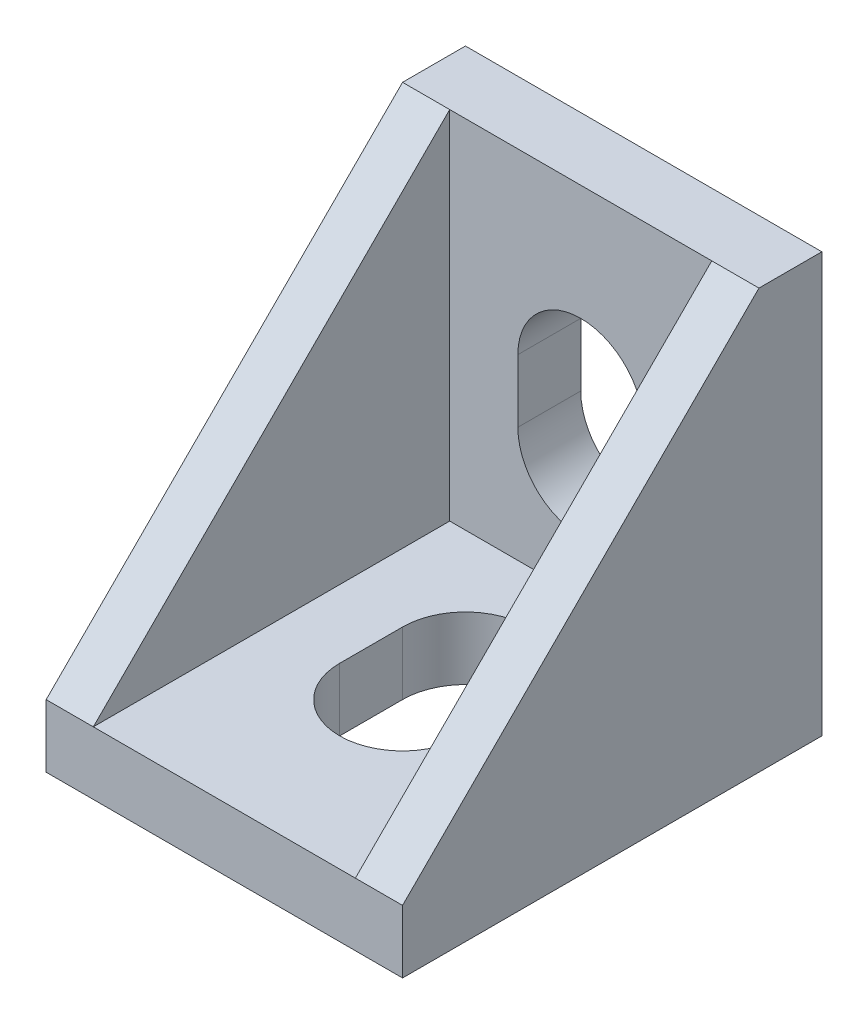
ISO-10303-21;
HEADER;
FILE_DESCRIPTION(('STEP AP214'),'2;1');
FILE_NAME('part.step','',(''),(''),'','','');
FILE_SCHEMA(('AUTOMOTIVE_DESIGN { 1 0 10303 214 1 1 1 1 }'));
ENDSEC;
DATA;
#1=APPLICATION_CONTEXT('core data for automotive mechanical design processes');
#2=APPLICATION_PROTOCOL_DEFINITION('international standard','automotive_design',2000,#1);
#3=PRODUCT_CONTEXT('',#1,'mechanical');
#4=PRODUCT('Part','Part','',(#3));
#5=PRODUCT_RELATED_PRODUCT_CATEGORY('part','',(#4));
#6=PRODUCT_DEFINITION_FORMATION('','',#4);
#7=PRODUCT_DEFINITION_CONTEXT('part definition',#1,'design');
#8=PRODUCT_DEFINITION('design','',#6,#7);
#9=PRODUCT_DEFINITION_SHAPE('','',#8);
#10=(LENGTH_UNIT() NAMED_UNIT(*) SI_UNIT(.MILLI.,.METRE.));
#11=(NAMED_UNIT(*) PLANE_ANGLE_UNIT() SI_UNIT($,.RADIAN.));
#12=(NAMED_UNIT(*) SI_UNIT($,.STERADIAN.) SOLID_ANGLE_UNIT());
#13=UNCERTAINTY_MEASURE_WITH_UNIT(LENGTH_MEASURE(1.E-05),#10,'distance_accuracy_value','');
#14=(GEOMETRIC_REPRESENTATION_CONTEXT(3) GLOBAL_UNCERTAINTY_ASSIGNED_CONTEXT((#13)) GLOBAL_UNIT_ASSIGNED_CONTEXT((#10,
#11,#12)) REPRESENTATION_CONTEXT('',''));
#15=CARTESIAN_POINT('',(0.,0.,0.));
#16=DIRECTION('',(0.,0.,1.));
#17=DIRECTION('',(1.,0.,0.));
#18=AXIS2_PLACEMENT_3D('',#15,#16,#17);
#19=CARTESIAN_POINT('',(17.,-10.,10.));
#20=DIRECTION('',(0.,1.,0.));
#21=DIRECTION('',(0.,0.,1.));
#22=AXIS2_PLACEMENT_3D('',#19,#20,#21);
#23=PLANE('',#22);
#24=CARTESIAN_POINT('',(9.525,-10.,-7.25));
#25=DIRECTION('',(0.,-1.,0.));
#26=DIRECTION('',(0.,0.,-1.));
#27=AXIS2_PLACEMENT_3D('',#24,#25,#26);
#28=CIRCLE('',#27,0.875);
#29=CARTESIAN_POINT('',(9.525,-10.,-8.125));
#30=VERTEX_POINT('',#29);
#31=CARTESIAN_POINT('',(9.525,-10.,-6.375));
#32=VERTEX_POINT('',#31);
#33=EDGE_CURVE('E263',#30,#32,#28,.T.);
#34=ORIENTED_EDGE('',*,*,#33,.F.);
#35=DIRECTION('',(1.,0.,0.));
#36=VECTOR('',#35,1.);
#37=CARTESIAN_POINT('',(9.525,-10.,-8.125));
#38=LINE('',#37,#36);
#39=CARTESIAN_POINT('',(7.475,-10.,-8.125));
#40=VERTEX_POINT('',#39);
#41=EDGE_CURVE('E276',#40,#30,#38,.T.);
#42=ORIENTED_EDGE('',*,*,#41,.F.);
#43=CARTESIAN_POINT('',(7.475,-10.,-7.25));
#44=DIRECTION('',(0.,-1.,0.));
#45=DIRECTION('',(0.,0.,-1.));
#46=AXIS2_PLACEMENT_3D('',#43,#44,#45);
#47=CIRCLE('',#46,0.875);
#48=CARTESIAN_POINT('',(7.475,-10.,-6.375));
#49=VERTEX_POINT('',#48);
#50=EDGE_CURVE('E285',#49,#40,#47,.T.);
#51=ORIENTED_EDGE('',*,*,#50,.F.);
#52=DIRECTION('',(-1.,0.,0.));
#53=VECTOR('',#52,1.);
#54=CARTESIAN_POINT('',(9.525,-10.,-6.375));
#55=LINE('',#54,#53);
#56=EDGE_CURVE('E266',#32,#49,#55,.T.);
#57=ORIENTED_EDGE('',*,*,#56,.F.);
#58=EDGE_LOOP('',(#34,#42,#51,#57));
#59=FACE_BOUND('',#58,.T.);
#60=DIRECTION('',(0.,0.,1.));
#61=VECTOR('',#60,1.);
#62=CARTESIAN_POINT('',(11.5,-10.,-1.5));
#63=LINE('',#62,#61);
#64=CARTESIAN_POINT('',(11.5,-10.,-1.5));
#65=VERTEX_POINT('',#64);
#66=CARTESIAN_POINT('',(11.5,-10.,1.5));
#67=VERTEX_POINT('',#66);
#68=EDGE_CURVE('E369',#65,#67,#63,.T.);
#69=ORIENTED_EDGE('',*,*,#68,.F.);
#70=CARTESIAN_POINT('',(8.5,-10.,-1.5));
#71=DIRECTION('',(0.,-1.,0.));
#72=DIRECTION('',(0.,0.,-1.));
#73=AXIS2_PLACEMENT_3D('',#70,#71,#72);
#74=CIRCLE('',#73,3.);
#75=CARTESIAN_POINT('',(5.5,-10.,-1.5));
#76=VERTEX_POINT('',#75);
#77=EDGE_CURVE('E367',#76,#65,#74,.T.);
#78=ORIENTED_EDGE('',*,*,#77,.F.);
#79=DIRECTION('',(0.,0.,-1.));
#80=VECTOR('',#79,1.);
#81=CARTESIAN_POINT('',(5.5,-10.,-1.5));
#82=LINE('',#81,#80);
#83=CARTESIAN_POINT('',(5.5,-10.,1.5));
#84=VERTEX_POINT('',#83);
#85=EDGE_CURVE('E375',#84,#76,#82,.T.);
#86=ORIENTED_EDGE('',*,*,#85,.F.);
#87=CARTESIAN_POINT('',(8.5,-10.,1.5));
#88=DIRECTION('',(0.,-1.,0.));
#89=DIRECTION('',(0.,0.,-1.));
#90=AXIS2_PLACEMENT_3D('',#87,#88,#89);
#91=CIRCLE('',#90,3.);
#92=EDGE_CURVE('E372',#67,#84,#91,.T.);
#93=ORIENTED_EDGE('',*,*,#92,.F.);
#94=EDGE_LOOP('',(#69,#78,#86,#93));
#95=FACE_BOUND('',#94,.T.);
#96=DIRECTION('',(0.,0.,-1.));
#97=VECTOR('',#96,1.);
#98=CARTESIAN_POINT('',(0.,-10.,10.));
#99=LINE('',#98,#97);
#100=CARTESIAN_POINT('',(0.,-10.,10.));
#101=VERTEX_POINT('',#100);
#102=CARTESIAN_POINT('',(0.,-10.,-10.));
#103=VERTEX_POINT('',#102);
#104=EDGE_CURVE('E434',#101,#103,#99,.T.);
#105=ORIENTED_EDGE('',*,*,#104,.T.);
#106=DIRECTION('',(-1.,0.,0.));
#107=VECTOR('',#106,1.);
#108=CARTESIAN_POINT('',(17.,-10.,-10.));
#109=LINE('',#108,#107);
#110=CARTESIAN_POINT('',(17.,-10.,-10.));
#111=VERTEX_POINT('',#110);
#112=EDGE_CURVE('E442',#111,#103,#109,.T.);
#113=ORIENTED_EDGE('',*,*,#112,.F.);
#114=DIRECTION('',(0.,0.,-1.));
#115=VECTOR('',#114,1.);
#116=CARTESIAN_POINT('',(17.,-10.,10.));
#117=LINE('',#116,#115);
#118=CARTESIAN_POINT('',(17.,-10.,10.));
#119=VERTEX_POINT('',#118);
#120=EDGE_CURVE('E440',#119,#111,#117,.T.);
#121=ORIENTED_EDGE('',*,*,#120,.F.);
#122=DIRECTION('',(-1.,0.,0.));
#123=VECTOR('',#122,1.);
#124=CARTESIAN_POINT('',(17.,-10.,10.));
#125=LINE('',#124,#123);
#126=EDGE_CURVE('E456',#119,#101,#125,.T.);
#127=ORIENTED_EDGE('',*,*,#126,.T.);
#128=EDGE_LOOP('',(#105,#113,#121,#127));
#129=FACE_BOUND('',#128,.T.);
#130=CARTESIAN_POINT('',(9.525,-10.,7.25));
#131=DIRECTION('',(0.,-1.,0.));
#132=DIRECTION('',(0.,0.,-1.));
#133=AXIS2_PLACEMENT_3D('',#130,#131,#132);
#134=CIRCLE('',#133,0.875000000000001);
#135=CARTESIAN_POINT('',(9.525,-10.,6.375));
#136=VERTEX_POINT('',#135);
#137=CARTESIAN_POINT('',(9.525,-10.,8.125));
#138=VERTEX_POINT('',#137);
#139=EDGE_CURVE('E262',#136,#138,#134,.T.);
#140=ORIENTED_EDGE('',*,*,#139,.F.);
#141=DIRECTION('',(1.,0.,0.));
#142=VECTOR('',#141,1.);
#143=CARTESIAN_POINT('',(9.525,-10.,6.375));
#144=LINE('',#143,#142);
#145=CARTESIAN_POINT('',(7.475,-10.,6.375));
#146=VERTEX_POINT('',#145);
#147=EDGE_CURVE('E259',#146,#136,#144,.T.);
#148=ORIENTED_EDGE('',*,*,#147,.F.);
#149=CARTESIAN_POINT('',(7.475,-10.,7.25));
#150=DIRECTION('',(0.,-1.,0.));
#151=DIRECTION('',(0.,0.,-1.));
#152=AXIS2_PLACEMENT_3D('',#149,#150,#151);
#153=CIRCLE('',#152,0.875000000000001);
#154=CARTESIAN_POINT('',(7.475,-10.,8.125));
#155=VERTEX_POINT('',#154);
#156=EDGE_CURVE('E54',#155,#146,#153,.T.);
#157=ORIENTED_EDGE('',*,*,#156,.F.);
#158=DIRECTION('',(-1.,0.,0.));
#159=VECTOR('',#158,1.);
#160=CARTESIAN_POINT('',(9.525,-10.,8.125));
#161=LINE('',#160,#159);
#162=EDGE_CURVE('E49',#138,#155,#161,.T.);
#163=ORIENTED_EDGE('',*,*,#162,.F.);
#164=EDGE_LOOP('',(#140,#148,#157,#163));
#165=FACE_BOUND('',#164,.T.);
#166=ADVANCED_FACE('F34',(#59,#95,#129,#165),#23,.F.);
#167=CARTESIAN_POINT('',(17.,10.,-10.));
#168=DIRECTION('',(0.,0.,1.));
#169=DIRECTION('',(0.,-1.,0.));
#170=AXIS2_PLACEMENT_3D('',#167,#168,#169);
#171=PLANE('',#170);
#172=CARTESIAN_POINT('',(9.525,7.25,-10.));
#173=DIRECTION('',(0.,0.,-1.));
#174=DIRECTION('',(0.,1.,0.));
#175=AXIS2_PLACEMENT_3D('',#172,#173,#174);
#176=CIRCLE('',#175,0.874999999999999);
#177=CARTESIAN_POINT('',(9.525,8.125,-10.));
#178=VERTEX_POINT('',#177);
#179=CARTESIAN_POINT('',(9.525,6.375,-10.));
#180=VERTEX_POINT('',#179);
#181=EDGE_CURVE('E334',#178,#180,#176,.T.);
#182=ORIENTED_EDGE('',*,*,#181,.F.);
#183=DIRECTION('',(1.,0.,0.));
#184=VECTOR('',#183,1.);
#185=CARTESIAN_POINT('',(9.525,8.125,-10.));
#186=LINE('',#185,#184);
#187=CARTESIAN_POINT('',(7.475,8.125,-10.));
#188=VERTEX_POINT('',#187);
#189=EDGE_CURVE('E339',#188,#178,#186,.T.);
#190=ORIENTED_EDGE('',*,*,#189,.F.);
#191=CARTESIAN_POINT('',(7.475,7.25,-10.));
#192=DIRECTION('',(0.,0.,-1.));
#193=DIRECTION('',(0.,1.,0.));
#194=AXIS2_PLACEMENT_3D('',#191,#192,#193);
#195=CIRCLE('',#194,0.874999999999999);
#196=CARTESIAN_POINT('',(7.475,6.375,-10.));
#197=VERTEX_POINT('',#196);
#198=EDGE_CURVE('E351',#197,#188,#195,.T.);
#199=ORIENTED_EDGE('',*,*,#198,.F.);
#200=DIRECTION('',(-1.,0.,0.));
#201=VECTOR('',#200,1.);
#202=CARTESIAN_POINT('',(9.525,6.375,-10.));
#203=LINE('',#202,#201);
#204=EDGE_CURVE('E348',#180,#197,#203,.T.);
#205=ORIENTED_EDGE('',*,*,#204,.F.);
#206=EDGE_LOOP('',(#182,#190,#199,#205));
#207=FACE_BOUND('',#206,.T.);
#208=DIRECTION('',(0.,-1.,0.));
#209=VECTOR('',#208,1.);
#210=CARTESIAN_POINT('',(11.5,1.5,-10.));
#211=LINE('',#210,#209);
#212=CARTESIAN_POINT('',(11.5,1.5,-10.));
#213=VERTEX_POINT('',#212);
#214=CARTESIAN_POINT('',(11.5,-1.5,-10.));
#215=VERTEX_POINT('',#214);
#216=EDGE_CURVE('E389',#213,#215,#211,.T.);
#217=ORIENTED_EDGE('',*,*,#216,.F.);
#218=CARTESIAN_POINT('',(8.5,1.5,-10.));
#219=DIRECTION('',(0.,0.,-1.));
#220=DIRECTION('',(0.,1.,0.));
#221=AXIS2_PLACEMENT_3D('',#218,#219,#220);
#222=CIRCLE('',#221,3.);
#223=CARTESIAN_POINT('',(5.5,1.5,-10.));
#224=VERTEX_POINT('',#223);
#225=EDGE_CURVE('E381',#224,#213,#222,.T.);
#226=ORIENTED_EDGE('',*,*,#225,.F.);
#227=DIRECTION('',(0.,-1.,0.));
#228=VECTOR('',#227,1.);
#229=CARTESIAN_POINT('',(5.5,1.5,-10.));
#230=LINE('',#229,#228);
#231=CARTESIAN_POINT('',(5.5,-1.5,-10.));
#232=VERTEX_POINT('',#231);
#233=EDGE_CURVE('E395',#224,#232,#230,.T.);
#234=ORIENTED_EDGE('',*,*,#233,.T.);
#235=CARTESIAN_POINT('',(8.5,-1.5,-10.));
#236=DIRECTION('',(0.,0.,-1.));
#237=DIRECTION('',(0.,1.,0.));
#238=AXIS2_PLACEMENT_3D('',#235,#236,#237);
#239=CIRCLE('',#238,3.);
#240=EDGE_CURVE('E392',#215,#232,#239,.T.);
#241=ORIENTED_EDGE('',*,*,#240,.F.);
#242=EDGE_LOOP('',(#217,#226,#234,#241));
#243=FACE_BOUND('',#242,.T.);
#244=DIRECTION('',(0.,1.,0.));
#245=VECTOR('',#244,1.);
#246=CARTESIAN_POINT('',(0.,10.,-10.));
#247=LINE('',#246,#245);
#248=CARTESIAN_POINT('',(0.,10.,-10.));
#249=VERTEX_POINT('',#248);
#250=EDGE_CURVE('E411',#103,#249,#247,.T.);
#251=ORIENTED_EDGE('',*,*,#250,.T.);
#252=DIRECTION('',(-1.,0.,0.));
#253=VECTOR('',#252,1.);
#254=CARTESIAN_POINT('',(17.,10.,-10.));
#255=LINE('',#254,#253);
#256=CARTESIAN_POINT('',(17.,10.,-10.));
#257=VERTEX_POINT('',#256);
#258=EDGE_CURVE('E467',#257,#249,#255,.T.);
#259=ORIENTED_EDGE('',*,*,#258,.F.);
#260=DIRECTION('',(0.,1.,0.));
#261=VECTOR('',#260,1.);
#262=CARTESIAN_POINT('',(17.,10.,-10.));
#263=LINE('',#262,#261);
#264=EDGE_CURVE('E430',#111,#257,#263,.T.);
#265=ORIENTED_EDGE('',*,*,#264,.F.);
#266=ORIENTED_EDGE('',*,*,#112,.T.);
#267=EDGE_LOOP('',(#251,#259,#265,#266));
#268=FACE_BOUND('',#267,.T.);
#269=CARTESIAN_POINT('',(9.525,-7.25,-10.));
#270=DIRECTION('',(0.,0.,-1.));
#271=DIRECTION('',(0.,1.,0.));
#272=AXIS2_PLACEMENT_3D('',#269,#270,#271);
#273=CIRCLE('',#272,0.875000000000002);
#274=CARTESIAN_POINT('',(9.525,-6.375,-10.));
#275=VERTEX_POINT('',#274);
#276=CARTESIAN_POINT('',(9.525,-8.125,-10.));
#277=VERTEX_POINT('',#276);
#278=EDGE_CURVE('E301',#275,#277,#273,.T.);
#279=ORIENTED_EDGE('',*,*,#278,.F.);
#280=DIRECTION('',(1.,0.,0.));
#281=VECTOR('',#280,1.);
#282=CARTESIAN_POINT('',(9.525,-6.375,-10.));
#283=LINE('',#282,#281);
#284=CARTESIAN_POINT('',(7.475,-6.375,-10.));
#285=VERTEX_POINT('',#284);
#286=EDGE_CURVE('E306',#285,#275,#283,.T.);
#287=ORIENTED_EDGE('',*,*,#286,.F.);
#288=CARTESIAN_POINT('',(7.475,-7.25,-10.));
#289=DIRECTION('',(0.,0.,-1.));
#290=DIRECTION('',(0.,1.,0.));
#291=AXIS2_PLACEMENT_3D('',#288,#289,#290);
#292=CIRCLE('',#291,0.875000000000002);
#293=CARTESIAN_POINT('',(7.475,-8.125,-10.));
#294=VERTEX_POINT('',#293);
#295=EDGE_CURVE('E318',#294,#285,#292,.T.);
#296=ORIENTED_EDGE('',*,*,#295,.F.);
#297=DIRECTION('',(-1.,0.,0.));
#298=VECTOR('',#297,1.);
#299=CARTESIAN_POINT('',(9.525,-8.125,-10.));
#300=LINE('',#299,#298);
#301=EDGE_CURVE('E315',#277,#294,#300,.T.);
#302=ORIENTED_EDGE('',*,*,#301,.F.);
#303=EDGE_LOOP('',(#279,#287,#296,#302));
#304=FACE_BOUND('',#303,.T.);
#305=ADVANCED_FACE('F36',(#207,#243,#268,#304),#171,.F.);
#306=CARTESIAN_POINT('',(17.,10.,-7.));
#307=DIRECTION('',(0.,-0.707106781186547,-0.707106781186548));
#308=DIRECTION('',(0.,0.707106781186548,-0.707106781186547));
#309=AXIS2_PLACEMENT_3D('',#306,#307,#308);
#310=PLANE('',#309);
#311=DIRECTION('',(0.,-0.707106781186548,0.707106781186547));
#312=VECTOR('',#311,1.);
#313=CARTESIAN_POINT('',(2.25,10.,-7.));
#314=LINE('',#313,#312);
#315=CARTESIAN_POINT('',(2.25,10.,-7.));
#316=VERTEX_POINT('',#315);
#317=CARTESIAN_POINT('',(2.25,-7.,10.));
#318=VERTEX_POINT('',#317);
#319=EDGE_CURVE('E414',#316,#318,#314,.T.);
#320=ORIENTED_EDGE('',*,*,#319,.F.);
#321=DIRECTION('',(-1.,0.,0.));
#322=VECTOR('',#321,1.);
#323=CARTESIAN_POINT('',(17.,10.,-7.));
#324=LINE('',#323,#322);
#325=CARTESIAN_POINT('',(0.,10.,-7.));
#326=VERTEX_POINT('',#325);
#327=EDGE_CURVE('E463',#316,#326,#324,.T.);
#328=ORIENTED_EDGE('',*,*,#327,.T.);
#329=DIRECTION('',(0.,-0.707106781186548,0.707106781186547));
#330=VECTOR('',#329,1.);
#331=CARTESIAN_POINT('',(0.,10.,-7.));
#332=LINE('',#331,#330);
#333=CARTESIAN_POINT('',(0.,-7.,10.));
#334=VERTEX_POINT('',#333);
#335=EDGE_CURVE('E448',#326,#334,#332,.T.);
#336=ORIENTED_EDGE('',*,*,#335,.T.);
#337=DIRECTION('',(-1.,0.,0.));
#338=VECTOR('',#337,1.);
#339=CARTESIAN_POINT('',(17.,-7.,10.));
#340=LINE('',#339,#338);
#341=EDGE_CURVE('E459',#318,#334,#340,.T.);
#342=ORIENTED_EDGE('',*,*,#341,.F.);
#343=EDGE_LOOP('',(#320,#328,#336,#342));
#344=FACE_BOUND('',#343,.T.);
#345=ADVANCED_FACE('F654',(#344),#310,.F.);
#346=CARTESIAN_POINT('',(17.,10.,-7.));
#347=DIRECTION('',(0.,-1.,0.));
#348=DIRECTION('',(0.,0.,-1.));
#349=AXIS2_PLACEMENT_3D('',#346,#347,#348);
#350=PLANE('',#349);
#351=DIRECTION('',(0.,0.,1.));
#352=VECTOR('',#351,1.);
#353=CARTESIAN_POINT('',(0.,10.,-7.));
#354=LINE('',#353,#352);
#355=EDGE_CURVE('E445',#249,#326,#354,.T.);
#356=ORIENTED_EDGE('',*,*,#355,.T.);
#357=ORIENTED_EDGE('',*,*,#327,.F.);
#358=DIRECTION('',(-1.,0.,0.));
#359=VECTOR('',#358,1.);
#360=CARTESIAN_POINT('',(17.,10.,-7.));
#361=LINE('',#360,#359);
#362=CARTESIAN_POINT('',(14.75,10.,-7.));
#363=VERTEX_POINT('',#362);
#364=EDGE_CURVE('E408',#363,#316,#361,.T.);
#365=ORIENTED_EDGE('',*,*,#364,.F.);
#366=CARTESIAN_POINT('',(17.,10.,-7.));
#367=VERTEX_POINT('',#366);
#368=EDGE_CURVE('E464',#367,#363,#324,.T.);
#369=ORIENTED_EDGE('',*,*,#368,.F.);
#370=DIRECTION('',(0.,0.,1.));
#371=VECTOR('',#370,1.);
#372=CARTESIAN_POINT('',(17.,10.,-7.));
#373=LINE('',#372,#371);
#374=EDGE_CURVE('E433',#257,#367,#373,.T.);
#375=ORIENTED_EDGE('',*,*,#374,.F.);
#376=ORIENTED_EDGE('',*,*,#258,.T.);
#377=EDGE_LOOP('',(#356,#357,#365,#369,#375,#376));
#378=FACE_BOUND('',#377,.T.);
#379=ADVANCED_FACE('F652',(#378),#350,.F.);
#380=ORIENTED_EDGE('',*,*,#368,.T.);
#381=DIRECTION('',(0.,-0.707106781186548,0.707106781186547));
#382=VECTOR('',#381,1.);
#383=CARTESIAN_POINT('',(14.75,10.,-7.));
#384=LINE('',#383,#382);
#385=CARTESIAN_POINT('',(14.75,-7.,10.));
#386=VERTEX_POINT('',#385);
#387=EDGE_CURVE('E417',#363,#386,#384,.T.);
#388=ORIENTED_EDGE('',*,*,#387,.T.);
#389=CARTESIAN_POINT('',(17.,-7.,10.));
#390=VERTEX_POINT('',#389);
#391=EDGE_CURVE('E460',#390,#386,#340,.T.);
#392=ORIENTED_EDGE('',*,*,#391,.F.);
#393=DIRECTION('',(0.,-0.707106781186548,0.707106781186547));
#394=VECTOR('',#393,1.);
#395=CARTESIAN_POINT('',(17.,10.,-7.));
#396=LINE('',#395,#394);
#397=EDGE_CURVE('E436',#367,#390,#396,.T.);
#398=ORIENTED_EDGE('',*,*,#397,.F.);
#399=EDGE_LOOP('',(#380,#388,#392,#398));
#400=FACE_BOUND('',#399,.T.);
#401=ADVANCED_FACE('F649',(#400),#310,.F.);
#402=CARTESIAN_POINT('',(17.,-7.,10.));
#403=DIRECTION('',(0.,0.,-1.));
#404=DIRECTION('',(-1.,0.,0.));
#405=AXIS2_PLACEMENT_3D('',#402,#403,#404);
#406=PLANE('',#405);
#407=DIRECTION('',(0.,-1.,0.));
#408=VECTOR('',#407,1.);
#409=CARTESIAN_POINT('',(0.,-7.,10.));
#410=LINE('',#409,#408);
#411=EDGE_CURVE('E451',#334,#101,#410,.T.);
#412=ORIENTED_EDGE('',*,*,#411,.T.);
#413=ORIENTED_EDGE('',*,*,#126,.F.);
#414=DIRECTION('',(0.,-1.,0.));
#415=VECTOR('',#414,1.);
#416=CARTESIAN_POINT('',(17.,-7.,10.));
#417=LINE('',#416,#415);
#418=EDGE_CURVE('E438',#390,#119,#417,.T.);
#419=ORIENTED_EDGE('',*,*,#418,.F.);
#420=ORIENTED_EDGE('',*,*,#391,.T.);
#421=DIRECTION('',(-1.,0.,0.));
#422=VECTOR('',#421,1.);
#423=CARTESIAN_POINT('',(17.,-7.,10.));
#424=LINE('',#423,#422);
#425=EDGE_CURVE('E412',#386,#318,#424,.T.);
#426=ORIENTED_EDGE('',*,*,#425,.T.);
#427=ORIENTED_EDGE('',*,*,#341,.T.);
#428=EDGE_LOOP('',(#412,#413,#419,#420,#426,#427));
#429=FACE_BOUND('',#428,.T.);
#430=ADVANCED_FACE('F642',(#429),#406,.F.);
#431=CARTESIAN_POINT('',(17.,0.,0.));
#432=DIRECTION('',(1.,0.,0.));
#433=DIRECTION('',(0.,0.,-1.));
#434=AXIS2_PLACEMENT_3D('',#431,#432,#433);
#435=PLANE('',#434);
#436=ORIENTED_EDGE('',*,*,#264,.T.);
#437=ORIENTED_EDGE('',*,*,#374,.T.);
#438=ORIENTED_EDGE('',*,*,#397,.T.);
#439=ORIENTED_EDGE('',*,*,#418,.T.);
#440=ORIENTED_EDGE('',*,*,#120,.T.);
#441=EDGE_LOOP('',(#436,#437,#438,#439,#440));
#442=FACE_BOUND('',#441,.T.);
#443=ADVANCED_FACE('F639',(#442),#435,.T.);
#444=CARTESIAN_POINT('',(0.,0.,0.));
#445=DIRECTION('',(1.,0.,0.));
#446=DIRECTION('',(0.,0.,-1.));
#447=AXIS2_PLACEMENT_3D('',#444,#445,#446);
#448=PLANE('',#447);
#449=ORIENTED_EDGE('',*,*,#250,.F.);
#450=ORIENTED_EDGE('',*,*,#104,.F.);
#451=ORIENTED_EDGE('',*,*,#411,.F.);
#452=ORIENTED_EDGE('',*,*,#335,.F.);
#453=ORIENTED_EDGE('',*,*,#355,.F.);
#454=EDGE_LOOP('',(#449,#450,#451,#452,#453));
#455=FACE_BOUND('',#454,.T.);
#456=ADVANCED_FACE('F628',(#455),#448,.F.);
#457=CARTESIAN_POINT('',(17.,10.,-7.));
#458=DIRECTION('',(0.,0.,1.));
#459=DIRECTION('',(0.,-1.,0.));
#460=AXIS2_PLACEMENT_3D('',#457,#458,#459);
#461=PLANE('',#460);
#462=CARTESIAN_POINT('',(8.5,1.5,-7.));
#463=DIRECTION('',(0.,0.,1.));
#464=DIRECTION('',(0.,-1.,0.));
#465=AXIS2_PLACEMENT_3D('',#462,#463,#464);
#466=CIRCLE('',#465,3.);
#467=CARTESIAN_POINT('',(11.5,1.5,-7.));
#468=VERTEX_POINT('',#467);
#469=CARTESIAN_POINT('',(5.5,1.5,-7.));
#470=VERTEX_POINT('',#469);
#471=EDGE_CURVE('E478',#468,#470,#466,.T.);
#472=ORIENTED_EDGE('',*,*,#471,.F.);
#473=DIRECTION('',(0.,1.,0.));
#474=VECTOR('',#473,1.);
#475=CARTESIAN_POINT('',(11.5,10.,-7.));
#476=LINE('',#475,#474);
#477=CARTESIAN_POINT('',(11.5,-1.5,-7.));
#478=VERTEX_POINT('',#477);
#479=EDGE_CURVE('E470',#478,#468,#476,.T.);
#480=ORIENTED_EDGE('',*,*,#479,.F.);
#481=CARTESIAN_POINT('',(8.5,-1.5,-7.));
#482=DIRECTION('',(0.,0.,1.));
#483=DIRECTION('',(0.,-1.,0.));
#484=AXIS2_PLACEMENT_3D('',#481,#482,#483);
#485=CIRCLE('',#484,3.);
#486=CARTESIAN_POINT('',(5.5,-1.5,-7.));
#487=VERTEX_POINT('',#486);
#488=EDGE_CURVE('E472',#487,#478,#485,.T.);
#489=ORIENTED_EDGE('',*,*,#488,.F.);
#490=DIRECTION('',(0.,1.,0.));
#491=VECTOR('',#490,1.);
#492=CARTESIAN_POINT('',(5.5,10.,-7.));
#493=LINE('',#492,#491);
#494=EDGE_CURVE('E475',#487,#470,#493,.T.);
#495=ORIENTED_EDGE('',*,*,#494,.T.);
#496=EDGE_LOOP('',(#472,#480,#489,#495));
#497=FACE_BOUND('',#496,.T.);
#498=DIRECTION('',(0.,1.,0.));
#499=VECTOR('',#498,1.);
#500=CARTESIAN_POINT('',(2.25,10.,-7.));
#501=LINE('',#500,#499);
#502=CARTESIAN_POINT('',(2.25,-7.,-7.));
#503=VERTEX_POINT('',#502);
#504=EDGE_CURVE('E401',#503,#316,#501,.T.);
#505=ORIENTED_EDGE('',*,*,#504,.F.);
#506=DIRECTION('',(-1.,0.,0.));
#507=VECTOR('',#506,1.);
#508=CARTESIAN_POINT('',(17.,-7.,-7.));
#509=LINE('',#508,#507);
#510=CARTESIAN_POINT('',(14.75,-7.,-7.));
#511=VERTEX_POINT('',#510);
#512=EDGE_CURVE('E419',#511,#503,#509,.T.);
#513=ORIENTED_EDGE('',*,*,#512,.F.);
#514=DIRECTION('',(0.,1.,0.));
#515=VECTOR('',#514,1.);
#516=CARTESIAN_POINT('',(14.75,10.,-7.));
#517=LINE('',#516,#515);
#518=EDGE_CURVE('E415',#511,#363,#517,.T.);
#519=ORIENTED_EDGE('',*,*,#518,.T.);
#520=ORIENTED_EDGE('',*,*,#364,.T.);
#521=EDGE_LOOP('',(#505,#513,#519,#520));
#522=FACE_BOUND('',#521,.T.);
#523=ADVANCED_FACE('F625',(#497,#522),#461,.T.);
#524=CARTESIAN_POINT('',(17.,-7.,10.));
#525=DIRECTION('',(0.,1.,0.));
#526=DIRECTION('',(0.,0.,1.));
#527=AXIS2_PLACEMENT_3D('',#524,#525,#526);
#528=PLANE('',#527);
#529=CARTESIAN_POINT('',(8.5,-7.,-1.5));
#530=DIRECTION('',(0.,1.,0.));
#531=DIRECTION('',(0.,0.,1.));
#532=AXIS2_PLACEMENT_3D('',#529,#530,#531);
#533=CIRCLE('',#532,3.);
#534=CARTESIAN_POINT('',(11.5,-7.,-1.5));
#535=VERTEX_POINT('',#534);
#536=CARTESIAN_POINT('',(5.5,-7.,-1.5));
#537=VERTEX_POINT('',#536);
#538=EDGE_CURVE('E11',#535,#537,#533,.T.);
#539=ORIENTED_EDGE('',*,*,#538,.F.);
#540=DIRECTION('',(0.,0.,-1.));
#541=VECTOR('',#540,1.);
#542=CARTESIAN_POINT('',(11.5,-7.,9.99999999999999));
#543=LINE('',#542,#541);
#544=CARTESIAN_POINT('',(11.5,-7.,1.5));
#545=VERTEX_POINT('',#544);
#546=EDGE_CURVE('E480',#545,#535,#543,.T.);
#547=ORIENTED_EDGE('',*,*,#546,.F.);
#548=CARTESIAN_POINT('',(8.5,-7.,1.5));
#549=DIRECTION('',(0.,1.,0.));
#550=DIRECTION('',(0.,0.,1.));
#551=AXIS2_PLACEMENT_3D('',#548,#549,#550);
#552=CIRCLE('',#551,3.);
#553=CARTESIAN_POINT('',(5.5,-7.,1.5));
#554=VERTEX_POINT('',#553);
#555=EDGE_CURVE('E482',#554,#545,#552,.T.);
#556=ORIENTED_EDGE('',*,*,#555,.F.);
#557=DIRECTION('',(0.,0.,1.));
#558=VECTOR('',#557,1.);
#559=CARTESIAN_POINT('',(5.5,-7.,10.));
#560=LINE('',#559,#558);
#561=EDGE_CURVE('E42',#537,#554,#560,.T.);
#562=ORIENTED_EDGE('',*,*,#561,.F.);
#563=EDGE_LOOP('',(#539,#547,#556,#562));
#564=FACE_BOUND('',#563,.T.);
#565=DIRECTION('',(0.,0.,-1.));
#566=VECTOR('',#565,1.);
#567=CARTESIAN_POINT('',(2.25,-7.,10.));
#568=LINE('',#567,#566);
#569=EDGE_CURVE('E418',#318,#503,#568,.T.);
#570=ORIENTED_EDGE('',*,*,#569,.F.);
#571=ORIENTED_EDGE('',*,*,#425,.F.);
#572=DIRECTION('',(0.,0.,-1.));
#573=VECTOR('',#572,1.);
#574=CARTESIAN_POINT('',(14.75,-7.,10.));
#575=LINE('',#574,#573);
#576=EDGE_CURVE('E422',#386,#511,#575,.T.);
#577=ORIENTED_EDGE('',*,*,#576,.T.);
#578=ORIENTED_EDGE('',*,*,#512,.T.);
#579=EDGE_LOOP('',(#570,#571,#577,#578));
#580=FACE_BOUND('',#579,.T.);
#581=ADVANCED_FACE('F497',(#564,#580),#528,.T.);
#582=CARTESIAN_POINT('',(14.75,0.,0.));
#583=DIRECTION('',(1.,0.,0.));
#584=DIRECTION('',(0.,0.,-1.));
#585=AXIS2_PLACEMENT_3D('',#582,#583,#584);
#586=PLANE('',#585);
#587=ORIENTED_EDGE('',*,*,#518,.F.);
#588=ORIENTED_EDGE('',*,*,#576,.F.);
#589=ORIENTED_EDGE('',*,*,#387,.F.);
#590=EDGE_LOOP('',(#587,#588,#589));
#591=FACE_BOUND('',#590,.T.);
#592=ADVANCED_FACE('F632',(#591),#586,.F.);
#593=CARTESIAN_POINT('',(2.25,0.,0.));
#594=DIRECTION('',(1.,0.,0.));
#595=DIRECTION('',(0.,0.,-1.));
#596=AXIS2_PLACEMENT_3D('',#593,#594,#595);
#597=PLANE('',#596);
#598=ORIENTED_EDGE('',*,*,#504,.T.);
#599=ORIENTED_EDGE('',*,*,#319,.T.);
#600=ORIENTED_EDGE('',*,*,#569,.T.);
#601=EDGE_LOOP('',(#598,#599,#600));
#602=FACE_BOUND('',#601,.T.);
#603=ADVANCED_FACE('F623',(#602),#597,.T.);
#604=CARTESIAN_POINT('',(8.5,1.5,10.));
#605=DIRECTION('',(0.,0.,-1.));
#606=DIRECTION('',(0.,1.,0.));
#607=AXIS2_PLACEMENT_3D('',#604,#605,#606);
#608=CYLINDRICAL_SURFACE('',#607,3.);
#609=ORIENTED_EDGE('',*,*,#471,.T.);
#610=DIRECTION('',(0.,0.,-1.));
#611=VECTOR('',#610,1.);
#612=CARTESIAN_POINT('',(5.5,1.5,10.));
#613=LINE('',#612,#611);
#614=EDGE_CURVE('E399',#470,#224,#613,.T.);
#615=ORIENTED_EDGE('',*,*,#614,.T.);
#616=ORIENTED_EDGE('',*,*,#225,.T.);
#617=DIRECTION('',(0.,0.,-1.));
#618=VECTOR('',#617,1.);
#619=CARTESIAN_POINT('',(11.5,1.5,10.));
#620=LINE('',#619,#618);
#621=EDGE_CURVE('E398',#468,#213,#620,.T.);
#622=ORIENTED_EDGE('',*,*,#621,.F.);
#623=EDGE_LOOP('',(#609,#615,#616,#622));
#624=FACE_BOUND('',#623,.T.);
#625=ADVANCED_FACE('F613',(#624),#608,.F.);
#626=CARTESIAN_POINT('',(5.5,1.5,10.));
#627=DIRECTION('',(1.,0.,0.));
#628=DIRECTION('',(0.,0.,-1.));
#629=AXIS2_PLACEMENT_3D('',#626,#627,#628);
#630=PLANE('',#629);
#631=DIRECTION('',(0.,0.,-1.));
#632=VECTOR('',#631,1.);
#633=CARTESIAN_POINT('',(5.5,-1.5,10.));
#634=LINE('',#633,#632);
#635=EDGE_CURVE('E402',#487,#232,#634,.T.);
#636=ORIENTED_EDGE('',*,*,#635,.T.);
#637=ORIENTED_EDGE('',*,*,#233,.F.);
#638=ORIENTED_EDGE('',*,*,#614,.F.);
#639=ORIENTED_EDGE('',*,*,#494,.F.);
#640=EDGE_LOOP('',(#636,#637,#638,#639));
#641=FACE_BOUND('',#640,.T.);
#642=ADVANCED_FACE('F609',(#641),#630,.T.);
#643=CARTESIAN_POINT('',(8.5,-1.5,10.));
#644=DIRECTION('',(0.,0.,-1.));
#645=DIRECTION('',(0.,1.,0.));
#646=AXIS2_PLACEMENT_3D('',#643,#644,#645);
#647=CYLINDRICAL_SURFACE('',#646,3.);
#648=ORIENTED_EDGE('',*,*,#488,.T.);
#649=DIRECTION('',(0.,0.,-1.));
#650=VECTOR('',#649,1.);
#651=CARTESIAN_POINT('',(11.5,-1.5,10.));
#652=LINE('',#651,#650);
#653=EDGE_CURVE('E404',#478,#215,#652,.T.);
#654=ORIENTED_EDGE('',*,*,#653,.T.);
#655=ORIENTED_EDGE('',*,*,#240,.T.);
#656=ORIENTED_EDGE('',*,*,#635,.F.);
#657=EDGE_LOOP('',(#648,#654,#655,#656));
#658=FACE_BOUND('',#657,.T.);
#659=ADVANCED_FACE('F612',(#658),#647,.F.);
#660=CARTESIAN_POINT('',(11.5,1.5,10.));
#661=DIRECTION('',(1.,0.,0.));
#662=DIRECTION('',(0.,1.,0.));
#663=AXIS2_PLACEMENT_3D('',#660,#661,#662);
#664=PLANE('',#663);
#665=ORIENTED_EDGE('',*,*,#479,.T.);
#666=ORIENTED_EDGE('',*,*,#621,.T.);
#667=ORIENTED_EDGE('',*,*,#216,.T.);
#668=ORIENTED_EDGE('',*,*,#653,.F.);
#669=EDGE_LOOP('',(#665,#666,#667,#668));
#670=FACE_BOUND('',#669,.T.);
#671=ADVANCED_FACE('F608',(#670),#664,.F.);
#672=CARTESIAN_POINT('',(8.5,10.,-1.5));
#673=DIRECTION('',(0.,-1.,0.));
#674=DIRECTION('',(0.,0.,-1.));
#675=AXIS2_PLACEMENT_3D('',#672,#673,#674);
#676=CYLINDRICAL_SURFACE('',#675,3.);
#677=ORIENTED_EDGE('',*,*,#538,.T.);
#678=DIRECTION('',(0.,-1.,0.));
#679=VECTOR('',#678,1.);
#680=CARTESIAN_POINT('',(5.5,10.,-1.5));
#681=LINE('',#680,#679);
#682=EDGE_CURVE('E379',#537,#76,#681,.T.);
#683=ORIENTED_EDGE('',*,*,#682,.T.);
#684=ORIENTED_EDGE('',*,*,#77,.T.);
#685=DIRECTION('',(0.,-1.,0.));
#686=VECTOR('',#685,1.);
#687=CARTESIAN_POINT('',(11.5,10.,-1.5));
#688=LINE('',#687,#686);
#689=EDGE_CURVE('E378',#535,#65,#688,.T.);
#690=ORIENTED_EDGE('',*,*,#689,.F.);
#691=EDGE_LOOP('',(#677,#683,#684,#690));
#692=FACE_BOUND('',#691,.T.);
#693=ADVANCED_FACE('F504',(#692),#676,.F.);
#694=CARTESIAN_POINT('',(5.5,10.,-1.5));
#695=DIRECTION('',(-1.,0.,0.));
#696=DIRECTION('',(0.,0.,1.));
#697=AXIS2_PLACEMENT_3D('',#694,#695,#696);
#698=PLANE('',#697);
#699=ORIENTED_EDGE('',*,*,#561,.T.);
#700=DIRECTION('',(0.,-1.,0.));
#701=VECTOR('',#700,1.);
#702=CARTESIAN_POINT('',(5.5,10.,1.5));
#703=LINE('',#702,#701);
#704=EDGE_CURVE('E382',#554,#84,#703,.T.);
#705=ORIENTED_EDGE('',*,*,#704,.T.);
#706=ORIENTED_EDGE('',*,*,#85,.T.);
#707=ORIENTED_EDGE('',*,*,#682,.F.);
#708=EDGE_LOOP('',(#699,#705,#706,#707));
#709=FACE_BOUND('',#708,.T.);
#710=ADVANCED_FACE('F488',(#709),#698,.F.);
#711=CARTESIAN_POINT('',(8.5,10.,1.5));
#712=DIRECTION('',(0.,-1.,0.));
#713=DIRECTION('',(0.,0.,-1.));
#714=AXIS2_PLACEMENT_3D('',#711,#712,#713);
#715=CYLINDRICAL_SURFACE('',#714,3.);
#716=ORIENTED_EDGE('',*,*,#555,.T.);
#717=DIRECTION('',(0.,-1.,0.));
#718=VECTOR('',#717,1.);
#719=CARTESIAN_POINT('',(11.5,10.,1.5));
#720=LINE('',#719,#718);
#721=EDGE_CURVE('E384',#545,#67,#720,.T.);
#722=ORIENTED_EDGE('',*,*,#721,.T.);
#723=ORIENTED_EDGE('',*,*,#92,.T.);
#724=ORIENTED_EDGE('',*,*,#704,.F.);
#725=EDGE_LOOP('',(#716,#722,#723,#724));
#726=FACE_BOUND('',#725,.T.);
#727=ADVANCED_FACE('F493',(#726),#715,.F.);
#728=CARTESIAN_POINT('',(11.5,10.,-1.5));
#729=DIRECTION('',(1.,0.,0.));
#730=DIRECTION('',(0.,0.,-1.));
#731=AXIS2_PLACEMENT_3D('',#728,#729,#730);
#732=PLANE('',#731);
#733=ORIENTED_EDGE('',*,*,#546,.T.);
#734=ORIENTED_EDGE('',*,*,#689,.T.);
#735=ORIENTED_EDGE('',*,*,#68,.T.);
#736=ORIENTED_EDGE('',*,*,#721,.F.);
#737=EDGE_LOOP('',(#733,#734,#735,#736));
#738=FACE_BOUND('',#737,.T.);
#739=ADVANCED_FACE('F501',(#738),#732,.F.);
#740=CARTESIAN_POINT('',(9.525,7.25,-11.));
#741=DIRECTION('',(0.,0.,1.));
#742=DIRECTION('',(0.,-1.,0.));
#743=AXIS2_PLACEMENT_3D('',#740,#741,#742);
#744=CYLINDRICAL_SURFACE('',#743,0.874999999999999);
#745=ORIENTED_EDGE('',*,*,#181,.T.);
#746=DIRECTION('',(0.,0.,1.));
#747=VECTOR('',#746,1.);
#748=CARTESIAN_POINT('',(9.525,6.375,-11.));
#749=LINE('',#748,#747);
#750=CARTESIAN_POINT('',(9.525,6.375,-11.));
#751=VERTEX_POINT('',#750);
#752=EDGE_CURVE('E364',#751,#180,#749,.T.);
#753=ORIENTED_EDGE('',*,*,#752,.F.);
#754=CARTESIAN_POINT('',(9.525,7.25,-11.));
#755=DIRECTION('',(0.,0.,-1.));
#756=DIRECTION('',(0.,1.,0.));
#757=AXIS2_PLACEMENT_3D('',#754,#755,#756);
#758=CIRCLE('',#757,0.874999999999999);
#759=CARTESIAN_POINT('',(9.525,8.125,-11.));
#760=VERTEX_POINT('',#759);
#761=EDGE_CURVE('E335',#760,#751,#758,.T.);
#762=ORIENTED_EDGE('',*,*,#761,.F.);
#763=DIRECTION('',(0.,0.,1.));
#764=VECTOR('',#763,1.);
#765=CARTESIAN_POINT('',(9.525,8.125,-11.));
#766=LINE('',#765,#764);
#767=EDGE_CURVE('E345',#760,#178,#766,.T.);
#768=ORIENTED_EDGE('',*,*,#767,.T.);
#769=EDGE_LOOP('',(#745,#753,#762,#768));
#770=FACE_BOUND('',#769,.T.);
#771=ADVANCED_FACE('F595',(#770),#744,.T.);
#772=CARTESIAN_POINT('',(9.525,6.375,-11.));
#773=DIRECTION('',(0.,1.,0.));
#774=DIRECTION('',(0.,0.,1.));
#775=AXIS2_PLACEMENT_3D('',#772,#773,#774);
#776=PLANE('',#775);
#777=ORIENTED_EDGE('',*,*,#204,.T.);
#778=DIRECTION('',(0.,0.,1.));
#779=VECTOR('',#778,1.);
#780=CARTESIAN_POINT('',(7.475,6.375,-11.));
#781=LINE('',#780,#779);
#782=CARTESIAN_POINT('',(7.475,6.375,-11.));
#783=VERTEX_POINT('',#782);
#784=EDGE_CURVE('E361',#783,#197,#781,.T.);
#785=ORIENTED_EDGE('',*,*,#784,.F.);
#786=DIRECTION('',(-1.,0.,0.));
#787=VECTOR('',#786,1.);
#788=CARTESIAN_POINT('',(9.525,6.375,-11.));
#789=LINE('',#788,#787);
#790=EDGE_CURVE('E338',#751,#783,#789,.T.);
#791=ORIENTED_EDGE('',*,*,#790,.F.);
#792=ORIENTED_EDGE('',*,*,#752,.T.);
#793=EDGE_LOOP('',(#777,#785,#791,#792));
#794=FACE_BOUND('',#793,.T.);
#795=ADVANCED_FACE('F591',(#794),#776,.F.);
#796=CARTESIAN_POINT('',(7.475,7.25,-11.));
#797=DIRECTION('',(0.,0.,1.));
#798=DIRECTION('',(0.,-1.,0.));
#799=AXIS2_PLACEMENT_3D('',#796,#797,#798);
#800=CYLINDRICAL_SURFACE('',#799,0.874999999999999);
#801=ORIENTED_EDGE('',*,*,#198,.T.);
#802=DIRECTION('',(0.,0.,1.));
#803=VECTOR('',#802,1.);
#804=CARTESIAN_POINT('',(7.475,8.125,-11.));
#805=LINE('',#804,#803);
#806=CARTESIAN_POINT('',(7.475,8.125,-11.));
#807=VERTEX_POINT('',#806);
#808=EDGE_CURVE('E358',#807,#188,#805,.T.);
#809=ORIENTED_EDGE('',*,*,#808,.F.);
#810=CARTESIAN_POINT('',(7.475,7.25,-11.));
#811=DIRECTION('',(0.,0.,-1.));
#812=DIRECTION('',(0.,1.,0.));
#813=AXIS2_PLACEMENT_3D('',#810,#811,#812);
#814=CIRCLE('',#813,0.874999999999999);
#815=EDGE_CURVE('E341',#783,#807,#814,.T.);
#816=ORIENTED_EDGE('',*,*,#815,.F.);
#817=ORIENTED_EDGE('',*,*,#784,.T.);
#818=EDGE_LOOP('',(#801,#809,#816,#817));
#819=FACE_BOUND('',#818,.T.);
#820=ADVANCED_FACE('F587',(#819),#800,.T.);
#821=CARTESIAN_POINT('',(9.525,8.125,-11.));
#822=DIRECTION('',(0.,-1.,0.));
#823=DIRECTION('',(0.,0.,-1.));
#824=AXIS2_PLACEMENT_3D('',#821,#822,#823);
#825=PLANE('',#824);
#826=ORIENTED_EDGE('',*,*,#189,.T.);
#827=ORIENTED_EDGE('',*,*,#767,.F.);
#828=DIRECTION('',(1.,0.,0.));
#829=VECTOR('',#828,1.);
#830=CARTESIAN_POINT('',(9.525,8.125,-11.));
#831=LINE('',#830,#829);
#832=EDGE_CURVE('E343',#807,#760,#831,.T.);
#833=ORIENTED_EDGE('',*,*,#832,.F.);
#834=ORIENTED_EDGE('',*,*,#808,.T.);
#835=EDGE_LOOP('',(#826,#827,#833,#834));
#836=FACE_BOUND('',#835,.T.);
#837=ADVANCED_FACE('F583',(#836),#825,.F.);
#838=CARTESIAN_POINT('',(9.525,7.25,-11.));
#839=DIRECTION('',(0.,0.,-1.));
#840=DIRECTION('',(0.,1.,0.));
#841=AXIS2_PLACEMENT_3D('',#838,#839,#840);
#842=PLANE('',#841);
#843=ORIENTED_EDGE('',*,*,#761,.T.);
#844=ORIENTED_EDGE('',*,*,#790,.T.);
#845=ORIENTED_EDGE('',*,*,#815,.T.);
#846=ORIENTED_EDGE('',*,*,#832,.T.);
#847=EDGE_LOOP('',(#843,#844,#845,#846));
#848=FACE_BOUND('',#847,.T.);
#849=ADVANCED_FACE('F579',(#848),#842,.T.);
#850=CARTESIAN_POINT('',(9.525,-7.25,-11.));
#851=DIRECTION('',(0.,0.,1.));
#852=DIRECTION('',(0.,-1.,0.));
#853=AXIS2_PLACEMENT_3D('',#850,#851,#852);
#854=CYLINDRICAL_SURFACE('',#853,0.875000000000002);
#855=ORIENTED_EDGE('',*,*,#278,.T.);
#856=DIRECTION('',(0.,0.,1.));
#857=VECTOR('',#856,1.);
#858=CARTESIAN_POINT('',(9.525,-8.125,-11.));
#859=LINE('',#858,#857);
#860=CARTESIAN_POINT('',(9.525,-8.125,-11.));
#861=VERTEX_POINT('',#860);
#862=EDGE_CURVE('E331',#861,#277,#859,.T.);
#863=ORIENTED_EDGE('',*,*,#862,.F.);
#864=CARTESIAN_POINT('',(9.525,-7.25,-11.));
#865=DIRECTION('',(0.,0.,-1.));
#866=DIRECTION('',(0.,1.,0.));
#867=AXIS2_PLACEMENT_3D('',#864,#865,#866);
#868=CIRCLE('',#867,0.875000000000002);
#869=CARTESIAN_POINT('',(9.525,-6.375,-11.));
#870=VERTEX_POINT('',#869);
#871=EDGE_CURVE('E302',#870,#861,#868,.T.);
#872=ORIENTED_EDGE('',*,*,#871,.F.);
#873=DIRECTION('',(0.,0.,1.));
#874=VECTOR('',#873,1.);
#875=CARTESIAN_POINT('',(9.525,-6.375,-11.));
#876=LINE('',#875,#874);
#877=EDGE_CURVE('E312',#870,#275,#876,.T.);
#878=ORIENTED_EDGE('',*,*,#877,.T.);
#879=EDGE_LOOP('',(#855,#863,#872,#878));
#880=FACE_BOUND('',#879,.T.);
#881=ADVANCED_FACE('F575',(#880),#854,.T.);
#882=CARTESIAN_POINT('',(9.525,-8.125,-11.));
#883=DIRECTION('',(0.,1.,0.));
#884=DIRECTION('',(0.,0.,1.));
#885=AXIS2_PLACEMENT_3D('',#882,#883,#884);
#886=PLANE('',#885);
#887=ORIENTED_EDGE('',*,*,#301,.T.);
#888=DIRECTION('',(0.,0.,1.));
#889=VECTOR('',#888,1.);
#890=CARTESIAN_POINT('',(7.475,-8.125,-11.));
#891=LINE('',#890,#889);
#892=CARTESIAN_POINT('',(7.475,-8.125,-11.));
#893=VERTEX_POINT('',#892);
#894=EDGE_CURVE('E328',#893,#294,#891,.T.);
#895=ORIENTED_EDGE('',*,*,#894,.F.);
#896=DIRECTION('',(-1.,0.,0.));
#897=VECTOR('',#896,1.);
#898=CARTESIAN_POINT('',(9.525,-8.125,-11.));
#899=LINE('',#898,#897);
#900=EDGE_CURVE('E305',#861,#893,#899,.T.);
#901=ORIENTED_EDGE('',*,*,#900,.F.);
#902=ORIENTED_EDGE('',*,*,#862,.T.);
#903=EDGE_LOOP('',(#887,#895,#901,#902));
#904=FACE_BOUND('',#903,.T.);
#905=ADVANCED_FACE('F571',(#904),#886,.F.);
#906=CARTESIAN_POINT('',(7.475,-7.25,-11.));
#907=DIRECTION('',(0.,0.,1.));
#908=DIRECTION('',(0.,-1.,0.));
#909=AXIS2_PLACEMENT_3D('',#906,#907,#908);
#910=CYLINDRICAL_SURFACE('',#909,0.875000000000002);
#911=ORIENTED_EDGE('',*,*,#295,.T.);
#912=DIRECTION('',(0.,0.,1.));
#913=VECTOR('',#912,1.);
#914=CARTESIAN_POINT('',(7.475,-6.375,-11.));
#915=LINE('',#914,#913);
#916=CARTESIAN_POINT('',(7.475,-6.375,-11.));
#917=VERTEX_POINT('',#916);
#918=EDGE_CURVE('E325',#917,#285,#915,.T.);
#919=ORIENTED_EDGE('',*,*,#918,.F.);
#920=CARTESIAN_POINT('',(7.475,-7.25,-11.));
#921=DIRECTION('',(0.,0.,-1.));
#922=DIRECTION('',(0.,1.,0.));
#923=AXIS2_PLACEMENT_3D('',#920,#921,#922);
#924=CIRCLE('',#923,0.875000000000002);
#925=EDGE_CURVE('E308',#893,#917,#924,.T.);
#926=ORIENTED_EDGE('',*,*,#925,.F.);
#927=ORIENTED_EDGE('',*,*,#894,.T.);
#928=EDGE_LOOP('',(#911,#919,#926,#927));
#929=FACE_BOUND('',#928,.T.);
#930=ADVANCED_FACE('F567',(#929),#910,.T.);
#931=CARTESIAN_POINT('',(9.525,-6.375,-11.));
#932=DIRECTION('',(0.,-1.,0.));
#933=DIRECTION('',(0.,0.,-1.));
#934=AXIS2_PLACEMENT_3D('',#931,#932,#933);
#935=PLANE('',#934);
#936=ORIENTED_EDGE('',*,*,#286,.T.);
#937=ORIENTED_EDGE('',*,*,#877,.F.);
#938=DIRECTION('',(1.,0.,0.));
#939=VECTOR('',#938,1.);
#940=CARTESIAN_POINT('',(9.525,-6.375,-11.));
#941=LINE('',#940,#939);
#942=EDGE_CURVE('E310',#917,#870,#941,.T.);
#943=ORIENTED_EDGE('',*,*,#942,.F.);
#944=ORIENTED_EDGE('',*,*,#918,.T.);
#945=EDGE_LOOP('',(#936,#937,#943,#944));
#946=FACE_BOUND('',#945,.T.);
#947=ADVANCED_FACE('F563',(#946),#935,.F.);
#948=CARTESIAN_POINT('',(9.525,-7.25,-11.));
#949=DIRECTION('',(0.,0.,-1.));
#950=DIRECTION('',(0.,1.,0.));
#951=AXIS2_PLACEMENT_3D('',#948,#949,#950);
#952=PLANE('',#951);
#953=ORIENTED_EDGE('',*,*,#871,.T.);
#954=ORIENTED_EDGE('',*,*,#900,.T.);
#955=ORIENTED_EDGE('',*,*,#925,.T.);
#956=ORIENTED_EDGE('',*,*,#942,.T.);
#957=EDGE_LOOP('',(#953,#954,#955,#956));
#958=FACE_BOUND('',#957,.T.);
#959=ADVANCED_FACE('F559',(#958),#952,.T.);
#960=CARTESIAN_POINT('',(9.525,-11.,-7.25));
#961=DIRECTION('',(0.,1.,0.));
#962=DIRECTION('',(0.,0.,1.));
#963=AXIS2_PLACEMENT_3D('',#960,#961,#962);
#964=CYLINDRICAL_SURFACE('',#963,0.875);
#965=ORIENTED_EDGE('',*,*,#33,.T.);
#966=DIRECTION('',(0.,1.,0.));
#967=VECTOR('',#966,1.);
#968=CARTESIAN_POINT('',(9.525,-11.,-6.375));
#969=LINE('',#968,#967);
#970=CARTESIAN_POINT('',(9.525,-11.,-6.375));
#971=VERTEX_POINT('',#970);
#972=EDGE_CURVE('E298',#971,#32,#969,.T.);
#973=ORIENTED_EDGE('',*,*,#972,.F.);
#974=CARTESIAN_POINT('',(9.525,-11.,-7.25));
#975=DIRECTION('',(0.,-1.,0.));
#976=DIRECTION('',(0.,0.,-1.));
#977=AXIS2_PLACEMENT_3D('',#974,#975,#976);
#978=CIRCLE('',#977,0.875);
#979=CARTESIAN_POINT('',(9.525,-11.,-8.125));
#980=VERTEX_POINT('',#979);
#981=EDGE_CURVE('E272',#980,#971,#978,.T.);
#982=ORIENTED_EDGE('',*,*,#981,.F.);
#983=DIRECTION('',(0.,1.,0.));
#984=VECTOR('',#983,1.);
#985=CARTESIAN_POINT('',(9.525,-11.,-8.125));
#986=LINE('',#985,#984);
#987=EDGE_CURVE('E281',#980,#30,#986,.T.);
#988=ORIENTED_EDGE('',*,*,#987,.T.);
#989=EDGE_LOOP('',(#965,#973,#982,#988));
#990=FACE_BOUND('',#989,.T.);
#991=ADVANCED_FACE('F555',(#990),#964,.T.);
#992=CARTESIAN_POINT('',(9.525,-11.,-6.375));
#993=DIRECTION('',(0.,0.,-1.));
#994=DIRECTION('',(-1.,0.,0.));
#995=AXIS2_PLACEMENT_3D('',#992,#993,#994);
#996=PLANE('',#995);
#997=ORIENTED_EDGE('',*,*,#56,.T.);
#998=DIRECTION('',(0.,1.,0.));
#999=VECTOR('',#998,1.);
#1000=CARTESIAN_POINT('',(7.475,-11.,-6.375));
#1001=LINE('',#1000,#999);
#1002=CARTESIAN_POINT('',(7.475,-11.,-6.375));
#1003=VERTEX_POINT('',#1002);
#1004=EDGE_CURVE('E295',#1003,#49,#1001,.T.);
#1005=ORIENTED_EDGE('',*,*,#1004,.F.);
#1006=DIRECTION('',(-1.,0.,0.));
#1007=VECTOR('',#1006,1.);
#1008=CARTESIAN_POINT('',(9.525,-11.,-6.375));
#1009=LINE('',#1008,#1007);
#1010=EDGE_CURVE('E275',#971,#1003,#1009,.T.);
#1011=ORIENTED_EDGE('',*,*,#1010,.F.);
#1012=ORIENTED_EDGE('',*,*,#972,.T.);
#1013=EDGE_LOOP('',(#997,#1005,#1011,#1012));
#1014=FACE_BOUND('',#1013,.T.);
#1015=ADVANCED_FACE('F551',(#1014),#996,.F.);
#1016=CARTESIAN_POINT('',(7.475,-11.,-7.25));
#1017=DIRECTION('',(0.,1.,0.));
#1018=DIRECTION('',(0.,0.,1.));
#1019=AXIS2_PLACEMENT_3D('',#1016,#1017,#1018);
#1020=CYLINDRICAL_SURFACE('',#1019,0.875);
#1021=ORIENTED_EDGE('',*,*,#50,.T.);
#1022=DIRECTION('',(0.,1.,0.));
#1023=VECTOR('',#1022,1.);
#1024=CARTESIAN_POINT('',(7.475,-11.,-8.125));
#1025=LINE('',#1024,#1023);
#1026=CARTESIAN_POINT('',(7.475,-11.,-8.125));
#1027=VERTEX_POINT('',#1026);
#1028=EDGE_CURVE('E292',#1027,#40,#1025,.T.);
#1029=ORIENTED_EDGE('',*,*,#1028,.F.);
#1030=CARTESIAN_POINT('',(7.475,-11.,-7.25));
#1031=DIRECTION('',(0.,-1.,0.));
#1032=DIRECTION('',(0.,0.,-1.));
#1033=AXIS2_PLACEMENT_3D('',#1030,#1031,#1032);
#1034=CIRCLE('',#1033,0.875);
#1035=EDGE_CURVE('E278',#1003,#1027,#1034,.T.);
#1036=ORIENTED_EDGE('',*,*,#1035,.F.);
#1037=ORIENTED_EDGE('',*,*,#1004,.T.);
#1038=EDGE_LOOP('',(#1021,#1029,#1036,#1037));
#1039=FACE_BOUND('',#1038,.T.);
#1040=ADVANCED_FACE('F547',(#1039),#1020,.T.);
#1041=CARTESIAN_POINT('',(9.525,-11.,-8.125));
#1042=DIRECTION('',(0.,0.,1.));
#1043=DIRECTION('',(1.,0.,0.));
#1044=AXIS2_PLACEMENT_3D('',#1041,#1042,#1043);
#1045=PLANE('',#1044);
#1046=ORIENTED_EDGE('',*,*,#41,.T.);
#1047=ORIENTED_EDGE('',*,*,#987,.F.);
#1048=DIRECTION('',(1.,0.,0.));
#1049=VECTOR('',#1048,1.);
#1050=CARTESIAN_POINT('',(9.525,-11.,-8.125));
#1051=LINE('',#1050,#1049);
#1052=EDGE_CURVE('E280',#1027,#980,#1051,.T.);
#1053=ORIENTED_EDGE('',*,*,#1052,.F.);
#1054=ORIENTED_EDGE('',*,*,#1028,.T.);
#1055=EDGE_LOOP('',(#1046,#1047,#1053,#1054));
#1056=FACE_BOUND('',#1055,.T.);
#1057=ADVANCED_FACE('F543',(#1056),#1045,.F.);
#1058=CARTESIAN_POINT('',(9.525,-11.,-7.25));
#1059=DIRECTION('',(0.,-1.,0.));
#1060=DIRECTION('',(0.,0.,-1.));
#1061=AXIS2_PLACEMENT_3D('',#1058,#1059,#1060);
#1062=PLANE('',#1061);
#1063=ORIENTED_EDGE('',*,*,#981,.T.);
#1064=ORIENTED_EDGE('',*,*,#1010,.T.);
#1065=ORIENTED_EDGE('',*,*,#1035,.T.);
#1066=ORIENTED_EDGE('',*,*,#1052,.T.);
#1067=EDGE_LOOP('',(#1063,#1064,#1065,#1066));
#1068=FACE_BOUND('',#1067,.T.);
#1069=ADVANCED_FACE('F540',(#1068),#1062,.T.);
#1070=CARTESIAN_POINT('',(9.525,-11.,7.25));
#1071=DIRECTION('',(0.,1.,0.));
#1072=DIRECTION('',(0.,0.,1.));
#1073=AXIS2_PLACEMENT_3D('',#1070,#1071,#1072);
#1074=CYLINDRICAL_SURFACE('',#1073,0.875000000000001);
#1075=ORIENTED_EDGE('',*,*,#139,.T.);
#1076=DIRECTION('',(0.,1.,0.));
#1077=VECTOR('',#1076,1.);
#1078=CARTESIAN_POINT('',(9.525,-11.,8.125));
#1079=LINE('',#1078,#1077);
#1080=CARTESIAN_POINT('',(9.525,-11.,8.125));
#1081=VERTEX_POINT('',#1080);
#1082=EDGE_CURVE('E243',#1081,#138,#1079,.T.);
#1083=ORIENTED_EDGE('',*,*,#1082,.F.);
#1084=CARTESIAN_POINT('',(9.525,-11.,7.25));
#1085=DIRECTION('',(0.,-1.,0.));
#1086=DIRECTION('',(0.,0.,-1.));
#1087=AXIS2_PLACEMENT_3D('',#1084,#1085,#1086);
#1088=CIRCLE('',#1087,0.875000000000001);
#1089=CARTESIAN_POINT('',(9.525,-11.,6.375));
#1090=VERTEX_POINT('',#1089);
#1091=EDGE_CURVE('E250',#1090,#1081,#1088,.T.);
#1092=ORIENTED_EDGE('',*,*,#1091,.F.);
#1093=DIRECTION('',(0.,1.,0.));
#1094=VECTOR('',#1093,1.);
#1095=CARTESIAN_POINT('',(9.525,-11.,6.375));
#1096=LINE('',#1095,#1094);
#1097=EDGE_CURVE('E518',#1090,#136,#1096,.T.);
#1098=ORIENTED_EDGE('',*,*,#1097,.T.);
#1099=EDGE_LOOP('',(#1075,#1083,#1092,#1098));
#1100=FACE_BOUND('',#1099,.T.);
#1101=ADVANCED_FACE('F261',(#1100),#1074,.T.);
#1102=CARTESIAN_POINT('',(9.525,-11.,8.125));
#1103=DIRECTION('',(0.,0.,-1.));
#1104=DIRECTION('',(-1.,0.,0.));
#1105=AXIS2_PLACEMENT_3D('',#1102,#1103,#1104);
#1106=PLANE('',#1105);
#1107=ORIENTED_EDGE('',*,*,#162,.T.);
#1108=DIRECTION('',(0.,1.,0.));
#1109=VECTOR('',#1108,1.);
#1110=CARTESIAN_POINT('',(7.475,-11.,8.125));
#1111=LINE('',#1110,#1109);
#1112=CARTESIAN_POINT('',(7.475,-11.,8.125));
#1113=VERTEX_POINT('',#1112);
#1114=EDGE_CURVE('E246',#1113,#155,#1111,.T.);
#1115=ORIENTED_EDGE('',*,*,#1114,.F.);
#1116=DIRECTION('',(-1.,0.,0.));
#1117=VECTOR('',#1116,1.);
#1118=CARTESIAN_POINT('',(9.525,-11.,8.125));
#1119=LINE('',#1118,#1117);
#1120=EDGE_CURVE('E239',#1081,#1113,#1119,.T.);
#1121=ORIENTED_EDGE('',*,*,#1120,.F.);
#1122=ORIENTED_EDGE('',*,*,#1082,.T.);
#1123=EDGE_LOOP('',(#1107,#1115,#1121,#1122));
#1124=FACE_BOUND('',#1123,.T.);
#1125=ADVANCED_FACE('F241',(#1124),#1106,.F.);
#1126=CARTESIAN_POINT('',(7.475,-11.,7.25));
#1127=DIRECTION('',(0.,1.,0.));
#1128=DIRECTION('',(0.,0.,1.));
#1129=AXIS2_PLACEMENT_3D('',#1126,#1127,#1128);
#1130=CYLINDRICAL_SURFACE('',#1129,0.875000000000001);
#1131=ORIENTED_EDGE('',*,*,#156,.T.);
#1132=DIRECTION('',(0.,1.,0.));
#1133=VECTOR('',#1132,1.);
#1134=CARTESIAN_POINT('',(7.475,-11.,6.375));
#1135=LINE('',#1134,#1133);
#1136=CARTESIAN_POINT('',(7.475,-11.,6.375));
#1137=VERTEX_POINT('',#1136);
#1138=EDGE_CURVE('E268',#1137,#146,#1135,.T.);
#1139=ORIENTED_EDGE('',*,*,#1138,.F.);
#1140=CARTESIAN_POINT('',(7.475,-11.,7.25));
#1141=DIRECTION('',(0.,-1.,0.));
#1142=DIRECTION('',(0.,0.,-1.));
#1143=AXIS2_PLACEMENT_3D('',#1140,#1141,#1142);
#1144=CIRCLE('',#1143,0.875000000000001);
#1145=EDGE_CURVE('E249',#1113,#1137,#1144,.T.);
#1146=ORIENTED_EDGE('',*,*,#1145,.F.);
#1147=ORIENTED_EDGE('',*,*,#1114,.T.);
#1148=EDGE_LOOP('',(#1131,#1139,#1146,#1147));
#1149=FACE_BOUND('',#1148,.T.);
#1150=ADVANCED_FACE('F527',(#1149),#1130,.T.);
#1151=CARTESIAN_POINT('',(9.525,-11.,6.375));
#1152=DIRECTION('',(0.,0.,1.));
#1153=DIRECTION('',(1.,0.,0.));
#1154=AXIS2_PLACEMENT_3D('',#1151,#1152,#1153);
#1155=PLANE('',#1154);
#1156=ORIENTED_EDGE('',*,*,#147,.T.);
#1157=ORIENTED_EDGE('',*,*,#1097,.F.);
#1158=DIRECTION('',(1.,0.,0.));
#1159=VECTOR('',#1158,1.);
#1160=CARTESIAN_POINT('',(9.525,-11.,6.375));
#1161=LINE('',#1160,#1159);
#1162=EDGE_CURVE('E255',#1137,#1090,#1161,.T.);
#1163=ORIENTED_EDGE('',*,*,#1162,.F.);
#1164=ORIENTED_EDGE('',*,*,#1138,.T.);
#1165=EDGE_LOOP('',(#1156,#1157,#1163,#1164));
#1166=FACE_BOUND('',#1165,.T.);
#1167=ADVANCED_FACE('F517',(#1166),#1155,.F.);
#1168=CARTESIAN_POINT('',(9.525,-11.,7.25));
#1169=DIRECTION('',(0.,-1.,0.));
#1170=DIRECTION('',(0.,0.,-1.));
#1171=AXIS2_PLACEMENT_3D('',#1168,#1169,#1170);
#1172=PLANE('',#1171);
#1173=ORIENTED_EDGE('',*,*,#1091,.T.);
#1174=ORIENTED_EDGE('',*,*,#1120,.T.);
#1175=ORIENTED_EDGE('',*,*,#1145,.T.);
#1176=ORIENTED_EDGE('',*,*,#1162,.T.);
#1177=EDGE_LOOP('',(#1173,#1174,#1175,#1176));
#1178=FACE_BOUND('',#1177,.T.);
#1179=ADVANCED_FACE('F253',(#1178),#1172,.T.);
#1180=CLOSED_SHELL('',(#166,#305,#345,#379,#401,#430,#443,#456,#523,#581,#592,#603,#625,#642,
#659,#671,#693,#710,#727,#739,#771,#795,#820,#837,#849,#881,#905,#930,#947,#959,#991,#1015,
#1040,#1057,#1069,#1101,#1125,#1150,#1167,#1179));
#1181=MANIFOLD_SOLID_BREP('B2',#1180);
#1182=ADVANCED_BREP_SHAPE_REPRESENTATION('',(#18,#1181),#14);
#1183=SHAPE_DEFINITION_REPRESENTATION(#9,#1182);
ENDSEC;
END-ISO-10303-21;
